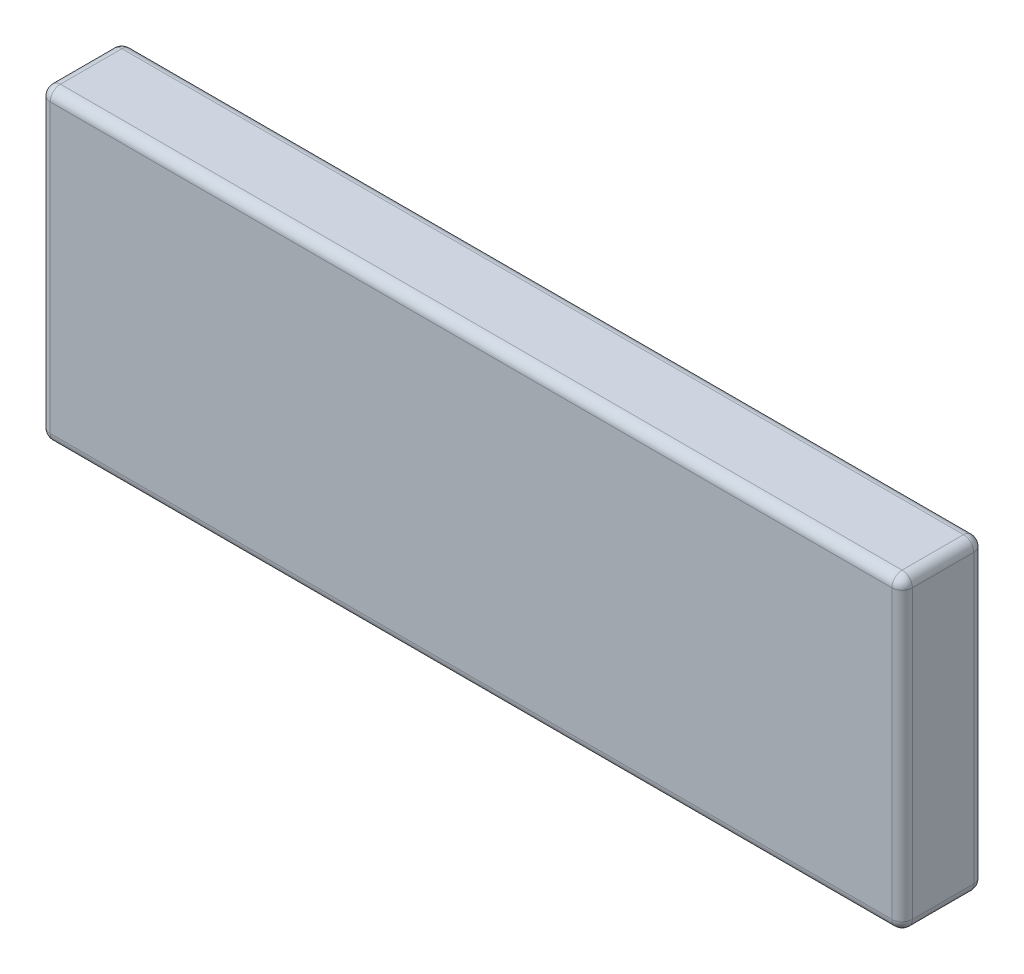
ISO-10303-21;
HEADER;
FILE_DESCRIPTION(('STEP AP214'),'2;1');
FILE_NAME('part.step','',(''),(''),'','','');
FILE_SCHEMA(('AUTOMOTIVE_DESIGN { 1 0 10303 214 1 1 1 1 }'));
ENDSEC;
DATA;
#1=APPLICATION_CONTEXT('core data for automotive mechanical design processes');
#2=APPLICATION_PROTOCOL_DEFINITION('international standard','automotive_design',2000,#1);
#3=PRODUCT_CONTEXT('',#1,'mechanical');
#4=PRODUCT('Part','Part','',(#3));
#5=PRODUCT_RELATED_PRODUCT_CATEGORY('part','',(#4));
#6=PRODUCT_DEFINITION_FORMATION('','',#4);
#7=PRODUCT_DEFINITION_CONTEXT('part definition',#1,'design');
#8=PRODUCT_DEFINITION('design','',#6,#7);
#9=PRODUCT_DEFINITION_SHAPE('','',#8);
#10=(LENGTH_UNIT() NAMED_UNIT(*) SI_UNIT(.MILLI.,.METRE.));
#11=(NAMED_UNIT(*) PLANE_ANGLE_UNIT() SI_UNIT($,.RADIAN.));
#12=(NAMED_UNIT(*) SI_UNIT($,.STERADIAN.) SOLID_ANGLE_UNIT());
#13=UNCERTAINTY_MEASURE_WITH_UNIT(LENGTH_MEASURE(1.E-05),#10,'distance_accuracy_value','');
#14=(GEOMETRIC_REPRESENTATION_CONTEXT(3) GLOBAL_UNCERTAINTY_ASSIGNED_CONTEXT((#13)) GLOBAL_UNIT_ASSIGNED_CONTEXT((#10,
#11,#12)) REPRESENTATION_CONTEXT('',''));
#15=CARTESIAN_POINT('',(0.,0.,0.));
#16=DIRECTION('',(0.,0.,1.));
#17=DIRECTION('',(1.,0.,0.));
#18=AXIS2_PLACEMENT_3D('',#15,#16,#17);
#19=CARTESIAN_POINT('',(0.,0.,8.));
#20=DIRECTION('',(1.,0.,0.));
#21=DIRECTION('',(0.,0.,-1.));
#22=AXIS2_PLACEMENT_3D('',#19,#20,#21);
#23=PLANE('',#22);
#24=DIRECTION('',(0.,-1.,0.));
#25=VECTOR('',#24,1.);
#26=CARTESIAN_POINT('',(0.,0.,7.));
#27=LINE('',#26,#25);
#28=CARTESIAN_POINT('',(0.,-29.0432430784005,7.));
#29=VERTEX_POINT('',#28);
#30=CARTESIAN_POINT('',(0.,-1.,7.));
#31=VERTEX_POINT('',#30);
#32=EDGE_CURVE('E227',#29,#31,#27,.F.);
#33=ORIENTED_EDGE('',*,*,#32,.T.);
#34=DIRECTION('',(0.,0.,-1.));
#35=VECTOR('',#34,1.);
#36=CARTESIAN_POINT('',(0.,-1.,8.));
#37=LINE('',#36,#35);
#38=CARTESIAN_POINT('',(0.,-1.,1.));
#39=VERTEX_POINT('',#38);
#40=EDGE_CURVE('E230',#31,#39,#37,.T.);
#41=ORIENTED_EDGE('',*,*,#40,.T.);
#42=DIRECTION('',(0.,-1.,0.));
#43=VECTOR('',#42,1.);
#44=CARTESIAN_POINT('',(0.,0.,1.));
#45=LINE('',#44,#43);
#46=CARTESIAN_POINT('',(0.,-29.0432430784005,1.));
#47=VERTEX_POINT('',#46);
#48=EDGE_CURVE('E221',#39,#47,#45,.T.);
#49=ORIENTED_EDGE('',*,*,#48,.T.);
#50=DIRECTION('',(0.,0.,-1.));
#51=VECTOR('',#50,1.);
#52=CARTESIAN_POINT('',(0.,-29.0432430784005,8.));
#53=LINE('',#52,#51);
#54=EDGE_CURVE('E224',#47,#29,#53,.F.);
#55=ORIENTED_EDGE('',*,*,#54,.T.);
#56=EDGE_LOOP('',(#33,#41,#49,#55));
#57=FACE_BOUND('',#56,.T.);
#58=ADVANCED_FACE('F41',(#57),#23,.F.);
#59=CARTESIAN_POINT('',(0.,-30.0432430784005,8.));
#60=DIRECTION('',(0.,1.,0.));
#61=DIRECTION('',(0.,0.,1.));
#62=AXIS2_PLACEMENT_3D('',#59,#60,#61);
#63=PLANE('',#62);
#64=DIRECTION('',(1.,0.,0.));
#65=VECTOR('',#64,1.);
#66=CARTESIAN_POINT('',(0.,-30.0432430784005,1.));
#67=LINE('',#66,#65);
#68=CARTESIAN_POINT('',(1.,-30.0432430784005,1.));
#69=VERTEX_POINT('',#68);
#70=CARTESIAN_POINT('',(83.1976239139885,-30.0432430784005,1.));
#71=VERTEX_POINT('',#70);
#72=EDGE_CURVE('E184',#69,#71,#67,.T.);
#73=ORIENTED_EDGE('',*,*,#72,.T.);
#74=DIRECTION('',(0.,0.,-1.));
#75=VECTOR('',#74,1.);
#76=CARTESIAN_POINT('',(83.1976239139885,-30.0432430784005,8.));
#77=LINE('',#76,#75);
#78=CARTESIAN_POINT('',(83.1976239139885,-30.0432430784005,7.));
#79=VERTEX_POINT('',#78);
#80=EDGE_CURVE('E193',#71,#79,#77,.F.);
#81=ORIENTED_EDGE('',*,*,#80,.T.);
#82=DIRECTION('',(1.,0.,0.));
#83=VECTOR('',#82,1.);
#84=CARTESIAN_POINT('',(0.,-30.0432430784005,7.));
#85=LINE('',#84,#83);
#86=CARTESIAN_POINT('',(1.,-30.0432430784005,7.));
#87=VERTEX_POINT('',#86);
#88=EDGE_CURVE('E190',#79,#87,#85,.F.);
#89=ORIENTED_EDGE('',*,*,#88,.T.);
#90=DIRECTION('',(0.,0.,-1.));
#91=VECTOR('',#90,1.);
#92=CARTESIAN_POINT('',(1.,-30.0432430784005,8.));
#93=LINE('',#92,#91);
#94=EDGE_CURVE('E187',#87,#69,#93,.T.);
#95=ORIENTED_EDGE('',*,*,#94,.T.);
#96=EDGE_LOOP('',(#73,#81,#89,#95));
#97=FACE_BOUND('',#96,.T.);
#98=ADVANCED_FACE('F338',(#97),#63,.F.);
#99=CARTESIAN_POINT('',(84.1976239139885,0.,8.));
#100=DIRECTION('',(-1.,0.,0.));
#101=DIRECTION('',(0.,0.,1.));
#102=AXIS2_PLACEMENT_3D('',#99,#100,#101);
#103=PLANE('',#102);
#104=DIRECTION('',(0.,0.,-1.));
#105=VECTOR('',#104,1.);
#106=CARTESIAN_POINT('',(84.1976239139885,-29.0432430784005,8.));
#107=LINE('',#106,#105);
#108=CARTESIAN_POINT('',(84.1976239139885,-29.0432430784005,7.));
#109=VERTEX_POINT('',#108);
#110=CARTESIAN_POINT('',(84.1976239139885,-29.0432430784005,1.));
#111=VERTEX_POINT('',#110);
#112=EDGE_CURVE('E145',#109,#111,#107,.T.);
#113=ORIENTED_EDGE('',*,*,#112,.T.);
#114=DIRECTION('',(0.,1.,0.));
#115=VECTOR('',#114,1.);
#116=CARTESIAN_POINT('',(84.1976239139885,0.,1.));
#117=LINE('',#116,#115);
#118=CARTESIAN_POINT('',(84.1976239139885,-1.,1.));
#119=VERTEX_POINT('',#118);
#120=EDGE_CURVE('E140',#111,#119,#117,.T.);
#121=ORIENTED_EDGE('',*,*,#120,.T.);
#122=DIRECTION('',(0.,0.,-1.));
#123=VECTOR('',#122,1.);
#124=CARTESIAN_POINT('',(84.1976239139885,-1.,8.));
#125=LINE('',#124,#123);
#126=CARTESIAN_POINT('',(84.1976239139885,-1.,7.));
#127=VERTEX_POINT('',#126);
#128=EDGE_CURVE('E132',#119,#127,#125,.F.);
#129=ORIENTED_EDGE('',*,*,#128,.T.);
#130=DIRECTION('',(0.,1.,0.));
#131=VECTOR('',#130,1.);
#132=CARTESIAN_POINT('',(84.1976239139885,-30.0432430784005,7.));
#133=LINE('',#132,#131);
#134=EDGE_CURVE('E137',#127,#109,#133,.F.);
#135=ORIENTED_EDGE('',*,*,#134,.T.);
#136=EDGE_LOOP('',(#113,#121,#129,#135));
#137=FACE_BOUND('',#136,.T.);
#138=ADVANCED_FACE('F135',(#137),#103,.F.);
#139=CARTESIAN_POINT('',(0.,0.,8.));
#140=DIRECTION('',(0.,-1.,0.));
#141=DIRECTION('',(0.,0.,-1.));
#142=AXIS2_PLACEMENT_3D('',#139,#140,#141);
#143=PLANE('',#142);
#144=DIRECTION('',(-1.,0.,0.));
#145=VECTOR('',#144,1.);
#146=CARTESIAN_POINT('',(84.1976239139885,0.,7.));
#147=LINE('',#146,#145);
#148=CARTESIAN_POINT('',(1.,0.,7.));
#149=VERTEX_POINT('',#148);
#150=CARTESIAN_POINT('',(83.1976239139885,0.,7.));
#151=VERTEX_POINT('',#150);
#152=EDGE_CURVE('E203',#149,#151,#147,.F.);
#153=ORIENTED_EDGE('',*,*,#152,.T.);
#154=DIRECTION('',(0.,0.,-1.));
#155=VECTOR('',#154,1.);
#156=CARTESIAN_POINT('',(83.1976239139885,0.,8.));
#157=LINE('',#156,#155);
#158=CARTESIAN_POINT('',(83.1976239139885,0.,1.));
#159=VERTEX_POINT('',#158);
#160=EDGE_CURVE('E153',#151,#159,#157,.T.);
#161=ORIENTED_EDGE('',*,*,#160,.T.);
#162=DIRECTION('',(-1.,0.,0.));
#163=VECTOR('',#162,1.);
#164=CARTESIAN_POINT('',(0.,0.,1.));
#165=LINE('',#164,#163);
#166=CARTESIAN_POINT('',(1.,0.,1.));
#167=VERTEX_POINT('',#166);
#168=EDGE_CURVE('E197',#159,#167,#165,.T.);
#169=ORIENTED_EDGE('',*,*,#168,.T.);
#170=DIRECTION('',(0.,0.,-1.));
#171=VECTOR('',#170,1.);
#172=CARTESIAN_POINT('',(1.,0.,8.));
#173=LINE('',#172,#171);
#174=EDGE_CURVE('E200',#167,#149,#173,.F.);
#175=ORIENTED_EDGE('',*,*,#174,.T.);
#176=EDGE_LOOP('',(#153,#161,#169,#175));
#177=FACE_BOUND('',#176,.T.);
#178=ADVANCED_FACE('F370',(#177),#143,.F.);
#179=CARTESIAN_POINT('',(0.,0.,8.));
#180=DIRECTION('',(0.,0.,1.));
#181=DIRECTION('',(1.,0.,0.));
#182=AXIS2_PLACEMENT_3D('',#179,#180,#181);
#183=PLANE('',#182);
#184=DIRECTION('',(-1.,0.,0.));
#185=VECTOR('',#184,1.);
#186=CARTESIAN_POINT('',(0.,-1.,8.));
#187=LINE('',#186,#185);
#188=CARTESIAN_POINT('',(83.1976239139885,-1.,8.));
#189=VERTEX_POINT('',#188);
#190=CARTESIAN_POINT('',(1.,-1.,8.));
#191=VERTEX_POINT('',#190);
#192=EDGE_CURVE('E214',#189,#191,#187,.T.);
#193=ORIENTED_EDGE('',*,*,#192,.T.);
#194=DIRECTION('',(0.,-1.,0.));
#195=VECTOR('',#194,1.);
#196=CARTESIAN_POINT('',(1.,-30.0432430784005,8.));
#197=LINE('',#196,#195);
#198=CARTESIAN_POINT('',(1.,-29.0432430784005,8.));
#199=VERTEX_POINT('',#198);
#200=EDGE_CURVE('E218',#191,#199,#197,.T.);
#201=ORIENTED_EDGE('',*,*,#200,.T.);
#202=DIRECTION('',(1.,0.,0.));
#203=VECTOR('',#202,1.);
#204=CARTESIAN_POINT('',(84.1976239139885,-29.0432430784005,8.));
#205=LINE('',#204,#203);
#206=CARTESIAN_POINT('',(83.1976239139885,-29.0432430784005,8.));
#207=VERTEX_POINT('',#206);
#208=EDGE_CURVE('E211',#199,#207,#205,.T.);
#209=ORIENTED_EDGE('',*,*,#208,.T.);
#210=DIRECTION('',(0.,1.,0.));
#211=VECTOR('',#210,1.);
#212=CARTESIAN_POINT('',(83.1976239139885,0.,8.));
#213=LINE('',#212,#211);
#214=EDGE_CURVE('E208',#207,#189,#213,.T.);
#215=ORIENTED_EDGE('',*,*,#214,.T.);
#216=EDGE_LOOP('',(#193,#201,#209,#215));
#217=FACE_BOUND('',#216,.T.);
#218=ADVANCED_FACE('F364',(#217),#183,.T.);
#219=CARTESIAN_POINT('',(0.,0.,0.));
#220=DIRECTION('',(0.,0.,1.));
#221=DIRECTION('',(1.,0.,0.));
#222=AXIS2_PLACEMENT_3D('',#219,#220,#221);
#223=PLANE('',#222);
#224=DIRECTION('',(0.,-1.,0.));
#225=VECTOR('',#224,1.);
#226=CARTESIAN_POINT('',(1.,0.,0.));
#227=LINE('',#226,#225);
#228=CARTESIAN_POINT('',(1.,-29.0432430784005,0.));
#229=VERTEX_POINT('',#228);
#230=CARTESIAN_POINT('',(1.,-1.,0.));
#231=VERTEX_POINT('',#230);
#232=EDGE_CURVE('E51',#229,#231,#227,.F.);
#233=ORIENTED_EDGE('',*,*,#232,.T.);
#234=DIRECTION('',(-1.,0.,0.));
#235=VECTOR('',#234,1.);
#236=CARTESIAN_POINT('',(0.,-1.,0.));
#237=LINE('',#236,#235);
#238=CARTESIAN_POINT('',(83.1976239139885,-1.,0.));
#239=VERTEX_POINT('',#238);
#240=EDGE_CURVE('E11',#231,#239,#237,.F.);
#241=ORIENTED_EDGE('',*,*,#240,.T.);
#242=DIRECTION('',(0.,1.,0.));
#243=VECTOR('',#242,1.);
#244=CARTESIAN_POINT('',(83.1976239139885,0.,0.));
#245=LINE('',#244,#243);
#246=CARTESIAN_POINT('',(83.1976239139885,-29.0432430784005,0.));
#247=VERTEX_POINT('',#246);
#248=EDGE_CURVE('E65',#239,#247,#245,.F.);
#249=ORIENTED_EDGE('',*,*,#248,.T.);
#250=DIRECTION('',(1.,0.,0.));
#251=VECTOR('',#250,1.);
#252=CARTESIAN_POINT('',(0.,-29.0432430784005,0.));
#253=LINE('',#252,#251);
#254=EDGE_CURVE('E234',#247,#229,#253,.F.);
#255=ORIENTED_EDGE('',*,*,#254,.T.);
#256=EDGE_LOOP('',(#233,#241,#249,#255));
#257=FACE_BOUND('',#256,.T.);
#258=ADVANCED_FACE('F322',(#257),#223,.F.);
#259=CARTESIAN_POINT('',(1.,-1.,8.));
#260=DIRECTION('',(0.,0.,-1.));
#261=DIRECTION('',(-1.,0.,0.));
#262=AXIS2_PLACEMENT_3D('',#259,#260,#261);
#263=CYLINDRICAL_SURFACE('',#262,1.);
#264=CARTESIAN_POINT('',(1.,-1.,7.));
#265=DIRECTION('',(0.,0.,1.));
#266=DIRECTION('',(1.,0.,0.));
#267=AXIS2_PLACEMENT_3D('',#264,#265,#266);
#268=CIRCLE('',#267,1.);
#269=EDGE_CURVE('E45',#149,#31,#268,.T.);
#270=ORIENTED_EDGE('',*,*,#269,.F.);
#271=ORIENTED_EDGE('',*,*,#174,.F.);
#272=CARTESIAN_POINT('',(1.,-1.,1.));
#273=DIRECTION('',(0.,0.,-1.));
#274=DIRECTION('',(-1.,0.,0.));
#275=AXIS2_PLACEMENT_3D('',#272,#273,#274);
#276=CIRCLE('',#275,1.);
#277=EDGE_CURVE('E178',#39,#167,#276,.T.);
#278=ORIENTED_EDGE('',*,*,#277,.F.);
#279=ORIENTED_EDGE('',*,*,#40,.F.);
#280=EDGE_LOOP('',(#270,#271,#278,#279));
#281=FACE_BOUND('',#280,.T.);
#282=ADVANCED_FACE('F43',(#281),#263,.T.);
#283=CARTESIAN_POINT('',(1.,-1.,7.));
#284=DIRECTION('',(0.,0.,1.));
#285=DIRECTION('',(1.,0.,0.));
#286=AXIS2_PLACEMENT_3D('',#283,#284,#285);
#287=SPHERICAL_SURFACE('',#286,1.);
#288=CARTESIAN_POINT('',(1.,-1.,7.));
#289=DIRECTION('',(-1.,0.,0.));
#290=DIRECTION('',(0.,0.,1.));
#291=AXIS2_PLACEMENT_3D('',#288,#289,#290);
#292=CIRCLE('',#291,1.);
#293=EDGE_CURVE('E300',#149,#191,#292,.F.);
#294=ORIENTED_EDGE('',*,*,#293,.F.);
#295=ORIENTED_EDGE('',*,*,#269,.T.);
#296=CARTESIAN_POINT('',(1.,-1.,7.));
#297=DIRECTION('',(0.,1.,0.));
#298=DIRECTION('',(0.,0.,1.));
#299=AXIS2_PLACEMENT_3D('',#296,#297,#298);
#300=CIRCLE('',#299,1.);
#301=EDGE_CURVE('E304',#191,#31,#300,.F.);
#302=ORIENTED_EDGE('',*,*,#301,.F.);
#303=EDGE_LOOP('',(#294,#295,#302));
#304=FACE_BOUND('',#303,.T.);
#305=ADVANCED_FACE('F357',(#304),#287,.T.);
#306=CARTESIAN_POINT('',(1.,-1.,1.));
#307=DIRECTION('',(0.,0.,1.));
#308=DIRECTION('',(1.,0.,0.));
#309=AXIS2_PLACEMENT_3D('',#306,#307,#308);
#310=SPHERICAL_SURFACE('',#309,1.);
#311=CARTESIAN_POINT('',(1.,-1.,1.));
#312=DIRECTION('',(0.,1.,0.));
#313=DIRECTION('',(0.,0.,1.));
#314=AXIS2_PLACEMENT_3D('',#311,#312,#313);
#315=CIRCLE('',#314,1.);
#316=EDGE_CURVE('E293',#39,#231,#315,.F.);
#317=ORIENTED_EDGE('',*,*,#316,.F.);
#318=ORIENTED_EDGE('',*,*,#277,.T.);
#319=CARTESIAN_POINT('',(1.,-1.,1.));
#320=DIRECTION('',(-1.,0.,0.));
#321=DIRECTION('',(0.,0.,1.));
#322=AXIS2_PLACEMENT_3D('',#319,#320,#321);
#323=CIRCLE('',#322,1.);
#324=EDGE_CURVE('E296',#231,#167,#323,.F.);
#325=ORIENTED_EDGE('',*,*,#324,.F.);
#326=EDGE_LOOP('',(#317,#318,#325));
#327=FACE_BOUND('',#326,.T.);
#328=ADVANCED_FACE('F313',(#327),#310,.T.);
#329=CARTESIAN_POINT('',(1.,0.,7.));
#330=DIRECTION('',(0.,1.,0.));
#331=DIRECTION('',(0.,0.,1.));
#332=AXIS2_PLACEMENT_3D('',#329,#330,#331);
#333=CYLINDRICAL_SURFACE('',#332,1.);
#334=ORIENTED_EDGE('',*,*,#301,.T.);
#335=ORIENTED_EDGE('',*,*,#32,.F.);
#336=CARTESIAN_POINT('',(1.,-29.0432430784005,7.));
#337=DIRECTION('',(0.,-1.,0.));
#338=DIRECTION('',(0.,0.,-1.));
#339=AXIS2_PLACEMENT_3D('',#336,#337,#338);
#340=CIRCLE('',#339,1.);
#341=EDGE_CURVE('E285',#199,#29,#340,.T.);
#342=ORIENTED_EDGE('',*,*,#341,.F.);
#343=ORIENTED_EDGE('',*,*,#200,.F.);
#344=EDGE_LOOP('',(#334,#335,#342,#343));
#345=FACE_BOUND('',#344,.T.);
#346=ADVANCED_FACE('F360',(#345),#333,.T.);
#347=CARTESIAN_POINT('',(0.,-1.,7.));
#348=DIRECTION('',(1.,0.,0.));
#349=DIRECTION('',(0.,0.,-1.));
#350=AXIS2_PLACEMENT_3D('',#347,#348,#349);
#351=CYLINDRICAL_SURFACE('',#350,1.);
#352=ORIENTED_EDGE('',*,*,#293,.T.);
#353=ORIENTED_EDGE('',*,*,#192,.F.);
#354=CARTESIAN_POINT('',(83.1976239139885,-1.,7.));
#355=DIRECTION('',(1.,0.,0.));
#356=DIRECTION('',(0.,0.,-1.));
#357=AXIS2_PLACEMENT_3D('',#354,#355,#356);
#358=CIRCLE('',#357,1.);
#359=EDGE_CURVE('E158',#151,#189,#358,.T.);
#360=ORIENTED_EDGE('',*,*,#359,.F.);
#361=ORIENTED_EDGE('',*,*,#152,.F.);
#362=EDGE_LOOP('',(#352,#353,#360,#361));
#363=FACE_BOUND('',#362,.T.);
#364=ADVANCED_FACE('F368',(#363),#351,.T.);
#365=CARTESIAN_POINT('',(83.1976239139885,-1.,8.));
#366=DIRECTION('',(0.,0.,-1.));
#367=DIRECTION('',(-1.,0.,0.));
#368=AXIS2_PLACEMENT_3D('',#365,#366,#367);
#369=CYLINDRICAL_SURFACE('',#368,1.);
#370=CARTESIAN_POINT('',(83.1976239139885,-1.,1.));
#371=DIRECTION('',(0.,0.,-1.));
#372=DIRECTION('',(-1.,0.,0.));
#373=AXIS2_PLACEMENT_3D('',#370,#371,#372);
#374=CIRCLE('',#373,1.);
#375=EDGE_CURVE('E159',#159,#119,#374,.T.);
#376=ORIENTED_EDGE('',*,*,#375,.F.);
#377=ORIENTED_EDGE('',*,*,#160,.F.);
#378=CARTESIAN_POINT('',(83.1976239139885,-1.,7.));
#379=DIRECTION('',(0.,0.,1.));
#380=DIRECTION('',(1.,0.,0.));
#381=AXIS2_PLACEMENT_3D('',#378,#379,#380);
#382=CIRCLE('',#381,1.);
#383=EDGE_CURVE('E149',#127,#151,#382,.T.);
#384=ORIENTED_EDGE('',*,*,#383,.F.);
#385=ORIENTED_EDGE('',*,*,#128,.F.);
#386=EDGE_LOOP('',(#376,#377,#384,#385));
#387=FACE_BOUND('',#386,.T.);
#388=ADVANCED_FACE('F151',(#387),#369,.T.);
#389=CARTESIAN_POINT('',(0.,-1.,1.));
#390=DIRECTION('',(-1.,0.,0.));
#391=DIRECTION('',(0.,0.,1.));
#392=AXIS2_PLACEMENT_3D('',#389,#390,#391);
#393=CYLINDRICAL_SURFACE('',#392,1.);
#394=ORIENTED_EDGE('',*,*,#324,.T.);
#395=ORIENTED_EDGE('',*,*,#168,.F.);
#396=CARTESIAN_POINT('',(83.1976239139885,-1.,1.));
#397=DIRECTION('',(1.,0.,0.));
#398=DIRECTION('',(0.,0.,-1.));
#399=AXIS2_PLACEMENT_3D('',#396,#397,#398);
#400=CIRCLE('',#399,1.);
#401=EDGE_CURVE('E278',#239,#159,#400,.T.);
#402=ORIENTED_EDGE('',*,*,#401,.F.);
#403=ORIENTED_EDGE('',*,*,#240,.F.);
#404=EDGE_LOOP('',(#394,#395,#402,#403));
#405=FACE_BOUND('',#404,.T.);
#406=ADVANCED_FACE('F320',(#405),#393,.T.);
#407=CARTESIAN_POINT('',(1.,0.,1.));
#408=DIRECTION('',(0.,-1.,0.));
#409=DIRECTION('',(0.,0.,-1.));
#410=AXIS2_PLACEMENT_3D('',#407,#408,#409);
#411=CYLINDRICAL_SURFACE('',#410,1.);
#412=ORIENTED_EDGE('',*,*,#316,.T.);
#413=ORIENTED_EDGE('',*,*,#232,.F.);
#414=CARTESIAN_POINT('',(1.,-29.0432430784005,1.));
#415=DIRECTION('',(0.,-1.,0.));
#416=DIRECTION('',(0.,0.,-1.));
#417=AXIS2_PLACEMENT_3D('',#414,#415,#416);
#418=CIRCLE('',#417,1.);
#419=EDGE_CURVE('E274',#47,#229,#418,.T.);
#420=ORIENTED_EDGE('',*,*,#419,.F.);
#421=ORIENTED_EDGE('',*,*,#48,.F.);
#422=EDGE_LOOP('',(#412,#413,#420,#421));
#423=FACE_BOUND('',#422,.T.);
#424=ADVANCED_FACE('F350',(#423),#411,.T.);
#425=CARTESIAN_POINT('',(1.,-29.0432430784005,8.));
#426=DIRECTION('',(0.,0.,-1.));
#427=DIRECTION('',(-1.,0.,0.));
#428=AXIS2_PLACEMENT_3D('',#425,#426,#427);
#429=CYLINDRICAL_SURFACE('',#428,1.);
#430=CARTESIAN_POINT('',(1.,-29.0432430784005,7.));
#431=DIRECTION('',(0.,0.,1.));
#432=DIRECTION('',(1.,0.,0.));
#433=AXIS2_PLACEMENT_3D('',#430,#431,#432);
#434=CIRCLE('',#433,1.);
#435=EDGE_CURVE('E289',#29,#87,#434,.T.);
#436=ORIENTED_EDGE('',*,*,#435,.F.);
#437=ORIENTED_EDGE('',*,*,#54,.F.);
#438=CARTESIAN_POINT('',(1.,-29.0432430784005,1.));
#439=DIRECTION('',(0.,0.,-1.));
#440=DIRECTION('',(-1.,0.,0.));
#441=AXIS2_PLACEMENT_3D('',#438,#439,#440);
#442=CIRCLE('',#441,1.);
#443=EDGE_CURVE('E270',#69,#47,#442,.T.);
#444=ORIENTED_EDGE('',*,*,#443,.F.);
#445=ORIENTED_EDGE('',*,*,#94,.F.);
#446=EDGE_LOOP('',(#436,#437,#444,#445));
#447=FACE_BOUND('',#446,.T.);
#448=ADVANCED_FACE('F345',(#447),#429,.T.);
#449=CARTESIAN_POINT('',(1.,-29.0432430784005,7.));
#450=DIRECTION('',(0.,0.,1.));
#451=DIRECTION('',(1.,0.,0.));
#452=AXIS2_PLACEMENT_3D('',#449,#450,#451);
#453=SPHERICAL_SURFACE('',#452,1.);
#454=ORIENTED_EDGE('',*,*,#341,.T.);
#455=ORIENTED_EDGE('',*,*,#435,.T.);
#456=CARTESIAN_POINT('',(1.,-29.0432430784005,7.));
#457=DIRECTION('',(-1.,0.,0.));
#458=DIRECTION('',(0.,0.,1.));
#459=AXIS2_PLACEMENT_3D('',#456,#457,#458);
#460=CIRCLE('',#459,1.);
#461=EDGE_CURVE('E167',#199,#87,#460,.F.);
#462=ORIENTED_EDGE('',*,*,#461,.F.);
#463=EDGE_LOOP('',(#454,#455,#462));
#464=FACE_BOUND('',#463,.T.);
#465=ADVANCED_FACE('F413',(#464),#453,.T.);
#466=CARTESIAN_POINT('',(83.1976239139885,-1.,7.));
#467=DIRECTION('',(0.,0.,1.));
#468=DIRECTION('',(1.,0.,0.));
#469=AXIS2_PLACEMENT_3D('',#466,#467,#468);
#470=SPHERICAL_SURFACE('',#469,1.);
#471=ORIENTED_EDGE('',*,*,#383,.T.);
#472=ORIENTED_EDGE('',*,*,#359,.T.);
#473=CARTESIAN_POINT('',(83.1976239139885,-1.,7.));
#474=DIRECTION('',(0.,1.,0.));
#475=DIRECTION('',(0.,0.,1.));
#476=AXIS2_PLACEMENT_3D('',#473,#474,#475);
#477=CIRCLE('',#476,1.);
#478=EDGE_CURVE('E162',#127,#189,#477,.F.);
#479=ORIENTED_EDGE('',*,*,#478,.F.);
#480=EDGE_LOOP('',(#471,#472,#479));
#481=FACE_BOUND('',#480,.T.);
#482=ADVANCED_FACE('F163',(#481),#470,.T.);
#483=CARTESIAN_POINT('',(83.1976239139885,-1.,1.));
#484=DIRECTION('',(0.,0.,1.));
#485=DIRECTION('',(1.,0.,0.));
#486=AXIS2_PLACEMENT_3D('',#483,#484,#485);
#487=SPHERICAL_SURFACE('',#486,1.);
#488=ORIENTED_EDGE('',*,*,#401,.T.);
#489=ORIENTED_EDGE('',*,*,#375,.T.);
#490=CARTESIAN_POINT('',(83.1976239139885,-1.,1.));
#491=DIRECTION('',(0.,1.,0.));
#492=DIRECTION('',(0.,0.,1.));
#493=AXIS2_PLACEMENT_3D('',#490,#491,#492);
#494=CIRCLE('',#493,1.);
#495=EDGE_CURVE('E168',#239,#119,#494,.F.);
#496=ORIENTED_EDGE('',*,*,#495,.F.);
#497=EDGE_LOOP('',(#488,#489,#496));
#498=FACE_BOUND('',#497,.T.);
#499=ADVANCED_FACE('F407',(#498),#487,.T.);
#500=CARTESIAN_POINT('',(1.,-29.0432430784005,1.));
#501=DIRECTION('',(0.,0.,1.));
#502=DIRECTION('',(1.,0.,0.));
#503=AXIS2_PLACEMENT_3D('',#500,#501,#502);
#504=SPHERICAL_SURFACE('',#503,1.);
#505=ORIENTED_EDGE('',*,*,#443,.T.);
#506=ORIENTED_EDGE('',*,*,#419,.T.);
#507=CARTESIAN_POINT('',(1.,-29.0432430784005,1.));
#508=DIRECTION('',(-1.,0.,0.));
#509=DIRECTION('',(0.,0.,1.));
#510=AXIS2_PLACEMENT_3D('',#507,#508,#509);
#511=CIRCLE('',#510,1.);
#512=EDGE_CURVE('E261',#69,#229,#511,.F.);
#513=ORIENTED_EDGE('',*,*,#512,.F.);
#514=EDGE_LOOP('',(#505,#506,#513));
#515=FACE_BOUND('',#514,.T.);
#516=ADVANCED_FACE('F348',(#515),#504,.T.);
#517=CARTESIAN_POINT('',(0.,-29.0432430784005,7.));
#518=DIRECTION('',(-1.,0.,0.));
#519=DIRECTION('',(0.,0.,1.));
#520=AXIS2_PLACEMENT_3D('',#517,#518,#519);
#521=CYLINDRICAL_SURFACE('',#520,1.);
#522=ORIENTED_EDGE('',*,*,#461,.T.);
#523=ORIENTED_EDGE('',*,*,#88,.F.);
#524=CARTESIAN_POINT('',(83.1976239139885,-29.0432430784005,7.));
#525=DIRECTION('',(1.,0.,0.));
#526=DIRECTION('',(0.,0.,-1.));
#527=AXIS2_PLACEMENT_3D('',#524,#525,#526);
#528=CIRCLE('',#527,1.);
#529=EDGE_CURVE('E257',#207,#79,#528,.T.);
#530=ORIENTED_EDGE('',*,*,#529,.F.);
#531=ORIENTED_EDGE('',*,*,#208,.F.);
#532=EDGE_LOOP('',(#522,#523,#530,#531));
#533=FACE_BOUND('',#532,.T.);
#534=ADVANCED_FACE('F401',(#533),#521,.T.);
#535=CARTESIAN_POINT('',(83.1976239139885,0.,7.));
#536=DIRECTION('',(0.,-1.,0.));
#537=DIRECTION('',(0.,0.,-1.));
#538=AXIS2_PLACEMENT_3D('',#535,#536,#537);
#539=CYLINDRICAL_SURFACE('',#538,1.);
#540=ORIENTED_EDGE('',*,*,#478,.T.);
#541=ORIENTED_EDGE('',*,*,#214,.F.);
#542=CARTESIAN_POINT('',(83.1976239139885,-29.0432430784005,7.));
#543=DIRECTION('',(0.,-1.,0.));
#544=DIRECTION('',(0.,0.,-1.));
#545=AXIS2_PLACEMENT_3D('',#542,#543,#544);
#546=CIRCLE('',#545,1.);
#547=EDGE_CURVE('E172',#109,#207,#546,.T.);
#548=ORIENTED_EDGE('',*,*,#547,.F.);
#549=ORIENTED_EDGE('',*,*,#134,.F.);
#550=EDGE_LOOP('',(#540,#541,#548,#549));
#551=FACE_BOUND('',#550,.T.);
#552=ADVANCED_FACE('F170',(#551),#539,.T.);
#553=CARTESIAN_POINT('',(83.1976239139885,0.,1.));
#554=DIRECTION('',(0.,1.,0.));
#555=DIRECTION('',(0.,0.,1.));
#556=AXIS2_PLACEMENT_3D('',#553,#554,#555);
#557=CYLINDRICAL_SURFACE('',#556,1.);
#558=ORIENTED_EDGE('',*,*,#495,.T.);
#559=ORIENTED_EDGE('',*,*,#120,.F.);
#560=CARTESIAN_POINT('',(83.1976239139885,-29.0432430784005,1.));
#561=DIRECTION('',(0.,-1.,0.));
#562=DIRECTION('',(0.,0.,-1.));
#563=AXIS2_PLACEMENT_3D('',#560,#561,#562);
#564=CIRCLE('',#563,1.);
#565=EDGE_CURVE('E251',#247,#111,#564,.T.);
#566=ORIENTED_EDGE('',*,*,#565,.F.);
#567=ORIENTED_EDGE('',*,*,#248,.F.);
#568=EDGE_LOOP('',(#558,#559,#566,#567));
#569=FACE_BOUND('',#568,.T.);
#570=ADVANCED_FACE('F330',(#569),#557,.T.);
#571=CARTESIAN_POINT('',(0.,-29.0432430784005,1.));
#572=DIRECTION('',(1.,0.,0.));
#573=DIRECTION('',(0.,0.,-1.));
#574=AXIS2_PLACEMENT_3D('',#571,#572,#573);
#575=CYLINDRICAL_SURFACE('',#574,1.);
#576=ORIENTED_EDGE('',*,*,#512,.T.);
#577=ORIENTED_EDGE('',*,*,#254,.F.);
#578=CARTESIAN_POINT('',(83.1976239139885,-29.0432430784005,1.));
#579=DIRECTION('',(1.,0.,0.));
#580=DIRECTION('',(0.,0.,-1.));
#581=AXIS2_PLACEMENT_3D('',#578,#579,#580);
#582=CIRCLE('',#581,1.);
#583=EDGE_CURVE('E247',#71,#247,#582,.T.);
#584=ORIENTED_EDGE('',*,*,#583,.F.);
#585=ORIENTED_EDGE('',*,*,#72,.F.);
#586=EDGE_LOOP('',(#576,#577,#584,#585));
#587=FACE_BOUND('',#586,.T.);
#588=ADVANCED_FACE('F326',(#587),#575,.T.);
#589=CARTESIAN_POINT('',(83.1976239139885,-29.0432430784005,7.));
#590=DIRECTION('',(0.,0.,1.));
#591=DIRECTION('',(1.,0.,0.));
#592=AXIS2_PLACEMENT_3D('',#589,#590,#591);
#593=SPHERICAL_SURFACE('',#592,1.);
#594=ORIENTED_EDGE('',*,*,#547,.T.);
#595=ORIENTED_EDGE('',*,*,#529,.T.);
#596=CARTESIAN_POINT('',(83.1976239139885,-29.0432430784005,7.));
#597=DIRECTION('',(0.,0.,1.));
#598=DIRECTION('',(1.,0.,0.));
#599=AXIS2_PLACEMENT_3D('',#596,#597,#598);
#600=CIRCLE('',#599,1.);
#601=EDGE_CURVE('E244',#109,#79,#600,.F.);
#602=ORIENTED_EDGE('',*,*,#601,.F.);
#603=EDGE_LOOP('',(#594,#595,#602));
#604=FACE_BOUND('',#603,.T.);
#605=ADVANCED_FACE('F391',(#604),#593,.T.);
#606=CARTESIAN_POINT('',(83.1976239139885,-29.0432430784005,1.));
#607=DIRECTION('',(0.,0.,1.));
#608=DIRECTION('',(1.,0.,0.));
#609=AXIS2_PLACEMENT_3D('',#606,#607,#608);
#610=SPHERICAL_SURFACE('',#609,1.);
#611=ORIENTED_EDGE('',*,*,#583,.T.);
#612=ORIENTED_EDGE('',*,*,#565,.T.);
#613=CARTESIAN_POINT('',(83.1976239139885,-29.0432430784005,1.));
#614=DIRECTION('',(0.,0.,-1.));
#615=DIRECTION('',(-1.,0.,0.));
#616=AXIS2_PLACEMENT_3D('',#613,#614,#615);
#617=CIRCLE('',#616,1.);
#618=EDGE_CURVE('E241',#71,#111,#617,.F.);
#619=ORIENTED_EDGE('',*,*,#618,.F.);
#620=EDGE_LOOP('',(#611,#612,#619));
#621=FACE_BOUND('',#620,.T.);
#622=ADVANCED_FACE('F333',(#621),#610,.T.);
#623=CARTESIAN_POINT('',(83.1976239139885,-29.0432430784005,8.));
#624=DIRECTION('',(0.,0.,-1.));
#625=DIRECTION('',(-1.,0.,0.));
#626=AXIS2_PLACEMENT_3D('',#623,#624,#625);
#627=CYLINDRICAL_SURFACE('',#626,1.);
#628=ORIENTED_EDGE('',*,*,#601,.T.);
#629=ORIENTED_EDGE('',*,*,#80,.F.);
#630=ORIENTED_EDGE('',*,*,#618,.T.);
#631=ORIENTED_EDGE('',*,*,#112,.F.);
#632=EDGE_LOOP('',(#628,#629,#630,#631));
#633=FACE_BOUND('',#632,.T.);
#634=ADVANCED_FACE('F336',(#633),#627,.T.);
#635=CLOSED_SHELL('',(#58,#98,#138,#178,#218,#258,#282,#305,#328,#346,#364,#388,#406,#424,#448,
#465,#482,#499,#516,#534,#552,#570,#588,#605,#622,#634));
#636=MANIFOLD_SOLID_BREP('B2',#635);
#637=ADVANCED_BREP_SHAPE_REPRESENTATION('',(#18,#636),#14);
#638=SHAPE_DEFINITION_REPRESENTATION(#9,#637);
ENDSEC;
END-ISO-10303-21;
